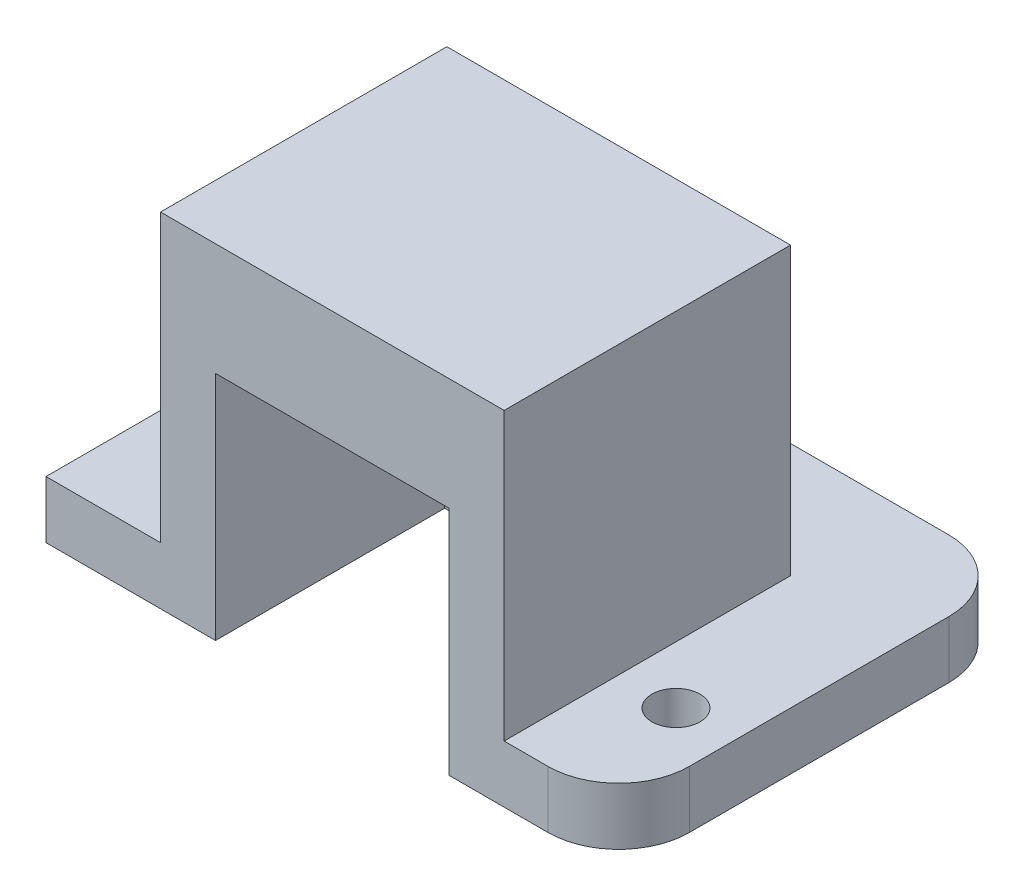
ISO-10303-21;
HEADER;
FILE_DESCRIPTION(('STEP AP214'),'2;1');
FILE_NAME('part.step','',(''),(''),'','','');
FILE_SCHEMA(('AUTOMOTIVE_DESIGN { 1 0 10303 214 1 1 1 1 }'));
ENDSEC;
DATA;
#1=APPLICATION_CONTEXT('core data for automotive mechanical design processes');
#2=APPLICATION_PROTOCOL_DEFINITION('international standard','automotive_design',2000,#1);
#3=PRODUCT_CONTEXT('',#1,'mechanical');
#4=PRODUCT('Part','Part','',(#3));
#5=PRODUCT_RELATED_PRODUCT_CATEGORY('part','',(#4));
#6=PRODUCT_DEFINITION_FORMATION('','',#4);
#7=PRODUCT_DEFINITION_CONTEXT('part definition',#1,'design');
#8=PRODUCT_DEFINITION('design','',#6,#7);
#9=PRODUCT_DEFINITION_SHAPE('','',#8);
#10=(LENGTH_UNIT() NAMED_UNIT(*) SI_UNIT(.MILLI.,.METRE.));
#11=(NAMED_UNIT(*) PLANE_ANGLE_UNIT() SI_UNIT($,.RADIAN.));
#12=(NAMED_UNIT(*) SI_UNIT($,.STERADIAN.) SOLID_ANGLE_UNIT());
#13=UNCERTAINTY_MEASURE_WITH_UNIT(LENGTH_MEASURE(1.E-05),#10,'distance_accuracy_value','');
#14=(GEOMETRIC_REPRESENTATION_CONTEXT(3) GLOBAL_UNCERTAINTY_ASSIGNED_CONTEXT((#13)) GLOBAL_UNIT_ASSIGNED_CONTEXT((#10,
#11,#12)) REPRESENTATION_CONTEXT('',''));
#15=CARTESIAN_POINT('',(0.,0.,0.));
#16=DIRECTION('',(0.,0.,1.));
#17=DIRECTION('',(1.,0.,0.));
#18=AXIS2_PLACEMENT_3D('',#15,#16,#17);
#19=CARTESIAN_POINT('',(18.83,0.,-3.83));
#20=DIRECTION('',(0.,1.,0.));
#21=DIRECTION('',(0.,0.,1.));
#22=AXIS2_PLACEMENT_3D('',#19,#20,#21);
#23=CYLINDRICAL_SURFACE('',#22,6.17);
#24=DIRECTION('',(0.,1.,0.));
#25=VECTOR('',#24,1.);
#26=CARTESIAN_POINT('',(25.,0.,-3.83));
#27=LINE('',#26,#25);
#28=CARTESIAN_POINT('',(25.,-15.,-3.83));
#29=VERTEX_POINT('',#28);
#30=CARTESIAN_POINT('',(25.,-9.99999999999999,-3.83));
#31=VERTEX_POINT('',#30);
#32=EDGE_CURVE('E247',#29,#31,#27,.T.);
#33=ORIENTED_EDGE('',*,*,#32,.F.);
#34=CARTESIAN_POINT('',(18.83,-15.,-3.83));
#35=DIRECTION('',(0.,1.,0.));
#36=DIRECTION('',(0.,0.,1.));
#37=AXIS2_PLACEMENT_3D('',#34,#35,#36);
#38=CIRCLE('',#37,6.17);
#39=CARTESIAN_POINT('',(18.83,-15.,-10.));
#40=VERTEX_POINT('',#39);
#41=EDGE_CURVE('E44',#40,#29,#38,.F.);
#42=ORIENTED_EDGE('',*,*,#41,.F.);
#43=DIRECTION('',(0.,1.,0.));
#44=VECTOR('',#43,1.);
#45=CARTESIAN_POINT('',(18.83,0.,-10.));
#46=LINE('',#45,#44);
#47=CARTESIAN_POINT('',(18.83,-9.99999999999999,-10.));
#48=VERTEX_POINT('',#47);
#49=EDGE_CURVE('E250',#48,#40,#46,.F.);
#50=ORIENTED_EDGE('',*,*,#49,.F.);
#51=CARTESIAN_POINT('',(18.83,-9.99999999999999,-3.83));
#52=DIRECTION('',(0.,-1.,0.));
#53=DIRECTION('',(0.,0.,-1.));
#54=AXIS2_PLACEMENT_3D('',#51,#52,#53);
#55=CIRCLE('',#54,6.17);
#56=EDGE_CURVE('E11',#31,#48,#55,.F.);
#57=ORIENTED_EDGE('',*,*,#56,.F.);
#58=EDGE_LOOP('',(#33,#42,#50,#57));
#59=FACE_BOUND('',#58,.T.);
#60=ADVANCED_FACE('F37',(#59),#23,.T.);
#61=CARTESIAN_POINT('',(18.83,0.,18.83));
#62=DIRECTION('',(0.,-1.,0.));
#63=DIRECTION('',(0.,0.,-1.));
#64=AXIS2_PLACEMENT_3D('',#61,#62,#63);
#65=CYLINDRICAL_SURFACE('',#64,6.17);
#66=DIRECTION('',(0.,-1.,0.));
#67=VECTOR('',#66,1.);
#68=CARTESIAN_POINT('',(25.,0.,18.83));
#69=LINE('',#68,#67);
#70=CARTESIAN_POINT('',(25.,-9.99999999999999,18.83));
#71=VERTEX_POINT('',#70);
#72=CARTESIAN_POINT('',(25.,-15.,18.83));
#73=VERTEX_POINT('',#72);
#74=EDGE_CURVE('E162',#71,#73,#69,.T.);
#75=ORIENTED_EDGE('',*,*,#74,.F.);
#76=CARTESIAN_POINT('',(18.83,-9.99999999999999,18.83));
#77=DIRECTION('',(0.,-1.,0.));
#78=DIRECTION('',(0.,0.,-1.));
#79=AXIS2_PLACEMENT_3D('',#76,#77,#78);
#80=CIRCLE('',#79,6.17);
#81=CARTESIAN_POINT('',(18.83,-9.99999999999999,25.));
#82=VERTEX_POINT('',#81);
#83=EDGE_CURVE('E243',#82,#71,#80,.F.);
#84=ORIENTED_EDGE('',*,*,#83,.F.);
#85=DIRECTION('',(0.,-1.,0.));
#86=VECTOR('',#85,1.);
#87=CARTESIAN_POINT('',(18.83,0.,25.));
#88=LINE('',#87,#86);
#89=CARTESIAN_POINT('',(18.83,-15.,25.));
#90=VERTEX_POINT('',#89);
#91=EDGE_CURVE('E142',#90,#82,#88,.F.);
#92=ORIENTED_EDGE('',*,*,#91,.F.);
#93=CARTESIAN_POINT('',(18.83,-15.,18.83));
#94=DIRECTION('',(0.,1.,0.));
#95=DIRECTION('',(0.,0.,1.));
#96=AXIS2_PLACEMENT_3D('',#93,#94,#95);
#97=CIRCLE('',#96,6.17);
#98=EDGE_CURVE('E245',#73,#90,#97,.F.);
#99=ORIENTED_EDGE('',*,*,#98,.F.);
#100=EDGE_LOOP('',(#75,#84,#92,#99));
#101=FACE_BOUND('',#100,.T.);
#102=ADVANCED_FACE('F304',(#101),#65,.T.);
#103=CARTESIAN_POINT('',(-15.,15.,5.));
#104=DIRECTION('',(1.,0.,0.));
#105=DIRECTION('',(0.,1.,0.));
#106=AXIS2_PLACEMENT_3D('',#103,#104,#105);
#107=PLANE('',#106);
#108=DIRECTION('',(0.,0.,-1.));
#109=VECTOR('',#108,1.);
#110=CARTESIAN_POINT('',(-15.,-9.99999999999999,-10.));
#111=LINE('',#110,#109);
#112=CARTESIAN_POINT('',(-15.,-9.99999999999999,25.));
#113=VERTEX_POINT('',#112);
#114=CARTESIAN_POINT('',(-15.,-9.99999999999999,0.));
#115=VERTEX_POINT('',#114);
#116=EDGE_CURVE('E145',#113,#115,#111,.T.);
#117=ORIENTED_EDGE('',*,*,#116,.F.);
#118=DIRECTION('',(0.,-1.,0.));
#119=VECTOR('',#118,1.);
#120=CARTESIAN_POINT('',(-15.,-15.,25.));
#121=LINE('',#120,#119);
#122=CARTESIAN_POINT('',(-15.,15.,25.));
#123=VERTEX_POINT('',#122);
#124=EDGE_CURVE('E186',#123,#113,#121,.T.);
#125=ORIENTED_EDGE('',*,*,#124,.F.);
#126=DIRECTION('',(0.,0.,-1.));
#127=VECTOR('',#126,1.);
#128=CARTESIAN_POINT('',(-15.,15.,5.));
#129=LINE('',#128,#127);
#130=CARTESIAN_POINT('',(-15.,15.,0.));
#131=VERTEX_POINT('',#130);
#132=EDGE_CURVE('E166',#123,#131,#129,.T.);
#133=ORIENTED_EDGE('',*,*,#132,.T.);
#134=DIRECTION('',(0.,-1.,0.));
#135=VECTOR('',#134,1.);
#136=CARTESIAN_POINT('',(-15.,15.,0.));
#137=LINE('',#136,#135);
#138=EDGE_CURVE('E230',#131,#115,#137,.T.);
#139=ORIENTED_EDGE('',*,*,#138,.T.);
#140=EDGE_LOOP('',(#117,#125,#133,#139));
#141=FACE_BOUND('',#140,.T.);
#142=ADVANCED_FACE('F309',(#141),#107,.F.);
#143=CARTESIAN_POINT('',(0.,0.,0.));
#144=DIRECTION('',(0.,0.,1.));
#145=DIRECTION('',(1.,0.,0.));
#146=AXIS2_PLACEMENT_3D('',#143,#144,#145);
#147=PLANE('',#146);
#148=DIRECTION('',(1.,0.,0.));
#149=VECTOR('',#148,1.);
#150=CARTESIAN_POINT('',(15.,-9.99999999999999,0.));
#151=LINE('',#150,#149);
#152=CARTESIAN_POINT('',(15.,-9.99999999999999,0.));
#153=VERTEX_POINT('',#152);
#154=EDGE_CURVE('E161',#115,#153,#151,.T.);
#155=ORIENTED_EDGE('',*,*,#154,.F.);
#156=ORIENTED_EDGE('',*,*,#138,.F.);
#157=DIRECTION('',(1.,0.,0.));
#158=VECTOR('',#157,1.);
#159=CARTESIAN_POINT('',(-15.,15.,0.));
#160=LINE('',#159,#158);
#161=CARTESIAN_POINT('',(15.,15.,0.));
#162=VERTEX_POINT('',#161);
#163=EDGE_CURVE('E234',#131,#162,#160,.T.);
#164=ORIENTED_EDGE('',*,*,#163,.T.);
#165=DIRECTION('',(0.,-1.,0.));
#166=VECTOR('',#165,1.);
#167=CARTESIAN_POINT('',(15.,15.,0.));
#168=LINE('',#167,#166);
#169=EDGE_CURVE('E237',#162,#153,#168,.T.);
#170=ORIENTED_EDGE('',*,*,#169,.T.);
#171=EDGE_LOOP('',(#155,#156,#164,#170));
#172=FACE_BOUND('',#171,.T.);
#173=ADVANCED_FACE('F314',(#172),#147,.F.);
#174=CARTESIAN_POINT('',(-15.,-15.,5.));
#175=DIRECTION('',(0.,1.,0.));
#176=DIRECTION('',(0.,0.,1.));
#177=AXIS2_PLACEMENT_3D('',#174,#175,#176);
#178=PLANE('',#177);
#179=CARTESIAN_POINT('',(-20.,-15.,15.));
#180=DIRECTION('',(0.,1.,0.));
#181=DIRECTION('',(0.,0.,1.));
#182=AXIS2_PLACEMENT_3D('',#179,#180,#181);
#183=CIRCLE('',#182,2.1);
#184=CARTESIAN_POINT('',(-20.,-15.,17.1));
#185=VERTEX_POINT('',#184);
#186=EDGE_CURVE('E261',#185,#185,#183,.T.);
#187=ORIENTED_EDGE('',*,*,#186,.T.);
#188=EDGE_LOOP('',(#187));
#189=FACE_BOUND('',#188,.T.);
#190=CARTESIAN_POINT('',(20.,-15.,15.));
#191=DIRECTION('',(0.,1.,0.));
#192=DIRECTION('',(0.,0.,1.));
#193=AXIS2_PLACEMENT_3D('',#190,#191,#192);
#194=CIRCLE('',#193,2.1);
#195=CARTESIAN_POINT('',(20.,-15.,17.1));
#196=VERTEX_POINT('',#195);
#197=EDGE_CURVE('E263',#196,#196,#194,.T.);
#198=ORIENTED_EDGE('',*,*,#197,.T.);
#199=EDGE_LOOP('',(#198));
#200=FACE_BOUND('',#199,.T.);
#201=CARTESIAN_POINT('',(0.,-15.,-5.));
#202=DIRECTION('',(0.,1.,0.));
#203=DIRECTION('',(0.,0.,1.));
#204=AXIS2_PLACEMENT_3D('',#201,#202,#203);
#205=CIRCLE('',#204,2.1);
#206=CARTESIAN_POINT('',(0.,-15.,-2.9));
#207=VERTEX_POINT('',#206);
#208=EDGE_CURVE('E220',#207,#207,#205,.T.);
#209=ORIENTED_EDGE('',*,*,#208,.T.);
#210=EDGE_LOOP('',(#209));
#211=FACE_BOUND('',#210,.T.);
#212=DIRECTION('',(-1.,0.,0.));
#213=VECTOR('',#212,1.);
#214=CARTESIAN_POINT('',(15.,-15.,-10.));
#215=LINE('',#214,#213);
#216=CARTESIAN_POINT('',(-25.,-15.,-10.));
#217=VERTEX_POINT('',#216);
#218=EDGE_CURVE('E225',#40,#217,#215,.T.);
#219=ORIENTED_EDGE('',*,*,#218,.F.);
#220=ORIENTED_EDGE('',*,*,#41,.T.);
#221=DIRECTION('',(0.,0.,-1.));
#222=VECTOR('',#221,1.);
#223=CARTESIAN_POINT('',(25.,-15.,25.));
#224=LINE('',#223,#222);
#225=EDGE_CURVE('E256',#73,#29,#224,.T.);
#226=ORIENTED_EDGE('',*,*,#225,.F.);
#227=ORIENTED_EDGE('',*,*,#98,.T.);
#228=DIRECTION('',(1.,0.,0.));
#229=VECTOR('',#228,1.);
#230=CARTESIAN_POINT('',(10.2,-15.,25.));
#231=LINE('',#230,#229);
#232=CARTESIAN_POINT('',(10.2,-15.,25.));
#233=VERTEX_POINT('',#232);
#234=EDGE_CURVE('E156',#233,#90,#231,.T.);
#235=ORIENTED_EDGE('',*,*,#234,.F.);
#236=DIRECTION('',(0.,0.,-1.));
#237=VECTOR('',#236,1.);
#238=CARTESIAN_POINT('',(10.2,-15.,25.));
#239=LINE('',#238,#237);
#240=CARTESIAN_POINT('',(10.2,-15.,5.));
#241=VERTEX_POINT('',#240);
#242=EDGE_CURVE('E200',#233,#241,#239,.T.);
#243=ORIENTED_EDGE('',*,*,#242,.T.);
#244=DIRECTION('',(1.,0.,0.));
#245=VECTOR('',#244,1.);
#246=CARTESIAN_POINT('',(-15.,-15.,5.));
#247=LINE('',#246,#245);
#248=CARTESIAN_POINT('',(-10.2,-15.,5.));
#249=VERTEX_POINT('',#248);
#250=EDGE_CURVE('E232',#249,#241,#247,.T.);
#251=ORIENTED_EDGE('',*,*,#250,.F.);
#252=DIRECTION('',(0.,0.,-1.));
#253=VECTOR('',#252,1.);
#254=CARTESIAN_POINT('',(-10.2,-15.,25.));
#255=LINE('',#254,#253);
#256=CARTESIAN_POINT('',(-10.2,-15.,25.));
#257=VERTEX_POINT('',#256);
#258=EDGE_CURVE('E216',#257,#249,#255,.T.);
#259=ORIENTED_EDGE('',*,*,#258,.F.);
#260=DIRECTION('',(1.,0.,0.));
#261=VECTOR('',#260,1.);
#262=CARTESIAN_POINT('',(-15.,-15.,25.));
#263=LINE('',#262,#261);
#264=CARTESIAN_POINT('',(-25.,-15.,25.));
#265=VERTEX_POINT('',#264);
#266=EDGE_CURVE('E189',#265,#257,#263,.T.);
#267=ORIENTED_EDGE('',*,*,#266,.F.);
#268=DIRECTION('',(0.,0.,1.));
#269=VECTOR('',#268,1.);
#270=CARTESIAN_POINT('',(-25.,-15.,-10.));
#271=LINE('',#270,#269);
#272=EDGE_CURVE('E174',#217,#265,#271,.T.);
#273=ORIENTED_EDGE('',*,*,#272,.F.);
#274=EDGE_LOOP('',(#219,#220,#226,#227,#235,#243,#251,#259,#267,#273));
#275=FACE_BOUND('',#274,.T.);
#276=ADVANCED_FACE('F254',(#189,#200,#211,#275),#178,.F.);
#277=CARTESIAN_POINT('',(15.,15.,5.));
#278=DIRECTION('',(1.,0.,0.));
#279=DIRECTION('',(0.,1.,0.));
#280=AXIS2_PLACEMENT_3D('',#277,#278,#279);
#281=PLANE('',#280);
#282=DIRECTION('',(0.,0.,1.));
#283=VECTOR('',#282,1.);
#284=CARTESIAN_POINT('',(15.,-9.99999999999999,25.));
#285=LINE('',#284,#283);
#286=CARTESIAN_POINT('',(15.,-9.99999999999999,25.));
#287=VERTEX_POINT('',#286);
#288=EDGE_CURVE('E151',#153,#287,#285,.T.);
#289=ORIENTED_EDGE('',*,*,#288,.F.);
#290=ORIENTED_EDGE('',*,*,#169,.F.);
#291=DIRECTION('',(0.,0.,-1.));
#292=VECTOR('',#291,1.);
#293=CARTESIAN_POINT('',(15.,15.,5.));
#294=LINE('',#293,#292);
#295=CARTESIAN_POINT('',(15.,15.,25.));
#296=VERTEX_POINT('',#295);
#297=EDGE_CURVE('E153',#296,#162,#294,.T.);
#298=ORIENTED_EDGE('',*,*,#297,.F.);
#299=DIRECTION('',(0.,1.,0.));
#300=VECTOR('',#299,1.);
#301=CARTESIAN_POINT('',(15.,-15.,25.));
#302=LINE('',#301,#300);
#303=EDGE_CURVE('E139',#287,#296,#302,.T.);
#304=ORIENTED_EDGE('',*,*,#303,.F.);
#305=EDGE_LOOP('',(#289,#290,#298,#304));
#306=FACE_BOUND('',#305,.T.);
#307=ADVANCED_FACE('F149',(#306),#281,.T.);
#308=CARTESIAN_POINT('',(-15.,15.,5.));
#309=DIRECTION('',(0.,1.,0.));
#310=DIRECTION('',(0.,0.,1.));
#311=AXIS2_PLACEMENT_3D('',#308,#309,#310);
#312=PLANE('',#311);
#313=ORIENTED_EDGE('',*,*,#163,.F.);
#314=ORIENTED_EDGE('',*,*,#132,.F.);
#315=DIRECTION('',(-1.,0.,0.));
#316=VECTOR('',#315,1.);
#317=CARTESIAN_POINT('',(-15.,15.,25.));
#318=LINE('',#317,#316);
#319=EDGE_CURVE('E155',#296,#123,#318,.T.);
#320=ORIENTED_EDGE('',*,*,#319,.F.);
#321=ORIENTED_EDGE('',*,*,#297,.T.);
#322=EDGE_LOOP('',(#313,#314,#320,#321));
#323=FACE_BOUND('',#322,.T.);
#324=ADVANCED_FACE('F323',(#323),#312,.T.);
#325=CARTESIAN_POINT('',(0.,0.,5.));
#326=DIRECTION('',(0.,0.,1.));
#327=DIRECTION('',(1.,0.,0.));
#328=AXIS2_PLACEMENT_3D('',#325,#326,#327);
#329=PLANE('',#328);
#330=DIRECTION('',(0.,-1.,0.));
#331=VECTOR('',#330,1.);
#332=CARTESIAN_POINT('',(10.2,-15.,5.));
#333=LINE('',#332,#331);
#334=CARTESIAN_POINT('',(10.2,5.2,5.));
#335=VERTEX_POINT('',#334);
#336=EDGE_CURVE('E190',#335,#241,#333,.T.);
#337=ORIENTED_EDGE('',*,*,#336,.F.);
#338=DIRECTION('',(1.,0.,0.));
#339=VECTOR('',#338,1.);
#340=CARTESIAN_POINT('',(-10.2,5.2,5.));
#341=LINE('',#340,#339);
#342=CARTESIAN_POINT('',(-10.2,5.2,5.));
#343=VERTEX_POINT('',#342);
#344=EDGE_CURVE('E203',#343,#335,#341,.T.);
#345=ORIENTED_EDGE('',*,*,#344,.F.);
#346=DIRECTION('',(0.,1.,0.));
#347=VECTOR('',#346,1.);
#348=CARTESIAN_POINT('',(-10.2,-15.,5.));
#349=LINE('',#348,#347);
#350=EDGE_CURVE('E185',#249,#343,#349,.T.);
#351=ORIENTED_EDGE('',*,*,#350,.F.);
#352=ORIENTED_EDGE('',*,*,#250,.T.);
#353=EDGE_LOOP('',(#337,#345,#351,#352));
#354=FACE_BOUND('',#353,.T.);
#355=ADVANCED_FACE('F281',(#354),#329,.T.);
#356=CARTESIAN_POINT('',(15.,-9.99999999999999,-10.));
#357=DIRECTION('',(0.,-1.,0.));
#358=DIRECTION('',(0.,0.,-1.));
#359=AXIS2_PLACEMENT_3D('',#356,#357,#358);
#360=PLANE('',#359);
#361=CARTESIAN_POINT('',(-20.,-9.99999999999999,15.));
#362=DIRECTION('',(0.,1.,0.));
#363=DIRECTION('',(0.,0.,1.));
#364=AXIS2_PLACEMENT_3D('',#361,#362,#363);
#365=CIRCLE('',#364,2.1);
#366=CARTESIAN_POINT('',(-20.,-9.99999999999999,17.1));
#367=VERTEX_POINT('',#366);
#368=EDGE_CURVE('E268',#367,#367,#365,.T.);
#369=ORIENTED_EDGE('',*,*,#368,.F.);
#370=EDGE_LOOP('',(#369));
#371=FACE_BOUND('',#370,.T.);
#372=CARTESIAN_POINT('',(20.,-9.99999999999999,15.));
#373=DIRECTION('',(0.,1.,0.));
#374=DIRECTION('',(0.,0.,1.));
#375=AXIS2_PLACEMENT_3D('',#372,#373,#374);
#376=CIRCLE('',#375,2.1);
#377=CARTESIAN_POINT('',(20.,-9.99999999999999,17.1));
#378=VERTEX_POINT('',#377);
#379=EDGE_CURVE('E269',#378,#378,#376,.T.);
#380=ORIENTED_EDGE('',*,*,#379,.F.);
#381=EDGE_LOOP('',(#380));
#382=FACE_BOUND('',#381,.T.);
#383=CARTESIAN_POINT('',(0.,-9.99999999999999,-5.));
#384=DIRECTION('',(0.,1.,0.));
#385=DIRECTION('',(0.,0.,1.));
#386=AXIS2_PLACEMENT_3D('',#383,#384,#385);
#387=CIRCLE('',#386,2.1);
#388=CARTESIAN_POINT('',(0.,-9.99999999999999,-2.9));
#389=VERTEX_POINT('',#388);
#390=EDGE_CURVE('E219',#389,#389,#387,.T.);
#391=ORIENTED_EDGE('',*,*,#390,.F.);
#392=EDGE_LOOP('',(#391));
#393=FACE_BOUND('',#392,.T.);
#394=DIRECTION('',(0.,0.,1.));
#395=VECTOR('',#394,1.);
#396=CARTESIAN_POINT('',(25.,-9.99999999999999,25.));
#397=LINE('',#396,#395);
#398=EDGE_CURVE('E146',#31,#71,#397,.T.);
#399=ORIENTED_EDGE('',*,*,#398,.F.);
#400=ORIENTED_EDGE('',*,*,#56,.T.);
#401=DIRECTION('',(1.,0.,0.));
#402=VECTOR('',#401,1.);
#403=CARTESIAN_POINT('',(15.,-9.99999999999999,-10.));
#404=LINE('',#403,#402);
#405=CARTESIAN_POINT('',(-25.,-9.99999999999999,-10.));
#406=VERTEX_POINT('',#405);
#407=EDGE_CURVE('E227',#406,#48,#404,.T.);
#408=ORIENTED_EDGE('',*,*,#407,.F.);
#409=DIRECTION('',(0.,0.,-1.));
#410=VECTOR('',#409,1.);
#411=CARTESIAN_POINT('',(-25.,-9.99999999999999,-10.));
#412=LINE('',#411,#410);
#413=CARTESIAN_POINT('',(-25.,-9.99999999999999,25.));
#414=VERTEX_POINT('',#413);
#415=EDGE_CURVE('E179',#414,#406,#412,.T.);
#416=ORIENTED_EDGE('',*,*,#415,.F.);
#417=DIRECTION('',(1.,0.,0.));
#418=VECTOR('',#417,1.);
#419=CARTESIAN_POINT('',(-25.,-9.99999999999999,25.));
#420=LINE('',#419,#418);
#421=EDGE_CURVE('E182',#414,#113,#420,.T.);
#422=ORIENTED_EDGE('',*,*,#421,.T.);
#423=ORIENTED_EDGE('',*,*,#116,.T.);
#424=ORIENTED_EDGE('',*,*,#154,.T.);
#425=ORIENTED_EDGE('',*,*,#288,.T.);
#426=DIRECTION('',(-1.,0.,0.));
#427=VECTOR('',#426,1.);
#428=CARTESIAN_POINT('',(25.,-9.99999999999999,25.));
#429=LINE('',#428,#427);
#430=EDGE_CURVE('E134',#82,#287,#429,.T.);
#431=ORIENTED_EDGE('',*,*,#430,.F.);
#432=ORIENTED_EDGE('',*,*,#83,.T.);
#433=EDGE_LOOP('',(#399,#400,#408,#416,#422,#423,#424,#425,#431,#432));
#434=FACE_BOUND('',#433,.T.);
#435=ADVANCED_FACE('F159',(#371,#382,#393,#434),#360,.F.);
#436=CARTESIAN_POINT('',(0.,0.,-10.));
#437=DIRECTION('',(0.,0.,1.));
#438=DIRECTION('',(1.,0.,0.));
#439=AXIS2_PLACEMENT_3D('',#436,#437,#438);
#440=PLANE('',#439);
#441=ORIENTED_EDGE('',*,*,#407,.T.);
#442=ORIENTED_EDGE('',*,*,#49,.T.);
#443=ORIENTED_EDGE('',*,*,#218,.T.);
#444=DIRECTION('',(0.,-1.,0.));
#445=VECTOR('',#444,1.);
#446=CARTESIAN_POINT('',(-25.,-15.,-10.));
#447=LINE('',#446,#445);
#448=EDGE_CURVE('E171',#406,#217,#447,.T.);
#449=ORIENTED_EDGE('',*,*,#448,.F.);
#450=EDGE_LOOP('',(#441,#442,#443,#449));
#451=FACE_BOUND('',#450,.T.);
#452=ADVANCED_FACE('F280',(#451),#440,.F.);
#453=CARTESIAN_POINT('',(0.,-15.,-5.));
#454=DIRECTION('',(0.,1.,0.));
#455=DIRECTION('',(0.,0.,1.));
#456=AXIS2_PLACEMENT_3D('',#453,#454,#455);
#457=CYLINDRICAL_SURFACE('',#456,2.1);
#458=ORIENTED_EDGE('',*,*,#208,.F.);
#459=EDGE_LOOP('',(#458));
#460=FACE_BOUND('',#459,.T.);
#461=ORIENTED_EDGE('',*,*,#390,.T.);
#462=EDGE_LOOP('',(#461));
#463=FACE_BOUND('',#462,.T.);
#464=ADVANCED_FACE('F287',(#460,#463),#457,.F.);
#465=CARTESIAN_POINT('',(-10.2,-15.,25.));
#466=DIRECTION('',(-1.,0.,0.));
#467=DIRECTION('',(0.,0.,1.));
#468=AXIS2_PLACEMENT_3D('',#465,#466,#467);
#469=PLANE('',#468);
#470=ORIENTED_EDGE('',*,*,#350,.T.);
#471=DIRECTION('',(0.,0.,-1.));
#472=VECTOR('',#471,1.);
#473=CARTESIAN_POINT('',(-10.2,5.2,25.));
#474=LINE('',#473,#472);
#475=CARTESIAN_POINT('',(-10.2,5.2,25.));
#476=VERTEX_POINT('',#475);
#477=EDGE_CURVE('E213',#476,#343,#474,.T.);
#478=ORIENTED_EDGE('',*,*,#477,.F.);
#479=DIRECTION('',(0.,1.,0.));
#480=VECTOR('',#479,1.);
#481=CARTESIAN_POINT('',(-10.2,-15.,25.));
#482=LINE('',#481,#480);
#483=EDGE_CURVE('E192',#257,#476,#482,.T.);
#484=ORIENTED_EDGE('',*,*,#483,.F.);
#485=ORIENTED_EDGE('',*,*,#258,.T.);
#486=EDGE_LOOP('',(#470,#478,#484,#485));
#487=FACE_BOUND('',#486,.T.);
#488=ADVANCED_FACE('F289',(#487),#469,.F.);
#489=CARTESIAN_POINT('',(-10.2,5.2,25.));
#490=DIRECTION('',(0.,1.,0.));
#491=DIRECTION('',(0.,0.,1.));
#492=AXIS2_PLACEMENT_3D('',#489,#490,#491);
#493=PLANE('',#492);
#494=ORIENTED_EDGE('',*,*,#344,.T.);
#495=DIRECTION('',(0.,0.,-1.));
#496=VECTOR('',#495,1.);
#497=CARTESIAN_POINT('',(10.2,5.2,25.));
#498=LINE('',#497,#496);
#499=CARTESIAN_POINT('',(10.2,5.2,25.));
#500=VERTEX_POINT('',#499);
#501=EDGE_CURVE('E210',#500,#335,#498,.T.);
#502=ORIENTED_EDGE('',*,*,#501,.F.);
#503=DIRECTION('',(1.,0.,0.));
#504=VECTOR('',#503,1.);
#505=CARTESIAN_POINT('',(-10.2,5.2,25.));
#506=LINE('',#505,#504);
#507=EDGE_CURVE('E194',#476,#500,#506,.T.);
#508=ORIENTED_EDGE('',*,*,#507,.F.);
#509=ORIENTED_EDGE('',*,*,#477,.T.);
#510=EDGE_LOOP('',(#494,#502,#508,#509));
#511=FACE_BOUND('',#510,.T.);
#512=ADVANCED_FACE('F296',(#511),#493,.F.);
#513=CARTESIAN_POINT('',(10.2,-15.,25.));
#514=DIRECTION('',(1.,0.,0.));
#515=DIRECTION('',(0.,0.,-1.));
#516=AXIS2_PLACEMENT_3D('',#513,#514,#515);
#517=PLANE('',#516);
#518=ORIENTED_EDGE('',*,*,#336,.T.);
#519=ORIENTED_EDGE('',*,*,#242,.F.);
#520=DIRECTION('',(0.,-1.,0.));
#521=VECTOR('',#520,1.);
#522=CARTESIAN_POINT('',(10.2,-15.,25.));
#523=LINE('',#522,#521);
#524=EDGE_CURVE('E196',#500,#233,#523,.T.);
#525=ORIENTED_EDGE('',*,*,#524,.F.);
#526=ORIENTED_EDGE('',*,*,#501,.T.);
#527=EDGE_LOOP('',(#518,#519,#525,#526));
#528=FACE_BOUND('',#527,.T.);
#529=ADVANCED_FACE('F343',(#528),#517,.F.);
#530=CARTESIAN_POINT('',(0.,0.,25.));
#531=DIRECTION('',(0.,0.,-1.));
#532=DIRECTION('',(-1.,0.,0.));
#533=AXIS2_PLACEMENT_3D('',#530,#531,#532);
#534=PLANE('',#533);
#535=ORIENTED_EDGE('',*,*,#234,.T.);
#536=ORIENTED_EDGE('',*,*,#91,.T.);
#537=ORIENTED_EDGE('',*,*,#430,.T.);
#538=ORIENTED_EDGE('',*,*,#303,.T.);
#539=ORIENTED_EDGE('',*,*,#319,.T.);
#540=ORIENTED_EDGE('',*,*,#124,.T.);
#541=ORIENTED_EDGE('',*,*,#421,.F.);
#542=DIRECTION('',(0.,1.,0.));
#543=VECTOR('',#542,1.);
#544=CARTESIAN_POINT('',(-25.,-15.,25.));
#545=LINE('',#544,#543);
#546=EDGE_CURVE('E177',#265,#414,#545,.T.);
#547=ORIENTED_EDGE('',*,*,#546,.F.);
#548=ORIENTED_EDGE('',*,*,#266,.T.);
#549=ORIENTED_EDGE('',*,*,#483,.T.);
#550=ORIENTED_EDGE('',*,*,#507,.T.);
#551=ORIENTED_EDGE('',*,*,#524,.T.);
#552=EDGE_LOOP('',(#535,#536,#537,#538,#539,#540,#541,#547,#548,#549,#550,#551));
#553=FACE_BOUND('',#552,.T.);
#554=ADVANCED_FACE('F137',(#553),#534,.F.);
#555=CARTESIAN_POINT('',(-25.,0.,0.));
#556=DIRECTION('',(1.,0.,0.));
#557=DIRECTION('',(0.,0.,-1.));
#558=AXIS2_PLACEMENT_3D('',#555,#556,#557);
#559=PLANE('',#558);
#560=ORIENTED_EDGE('',*,*,#448,.T.);
#561=ORIENTED_EDGE('',*,*,#272,.T.);
#562=ORIENTED_EDGE('',*,*,#546,.T.);
#563=ORIENTED_EDGE('',*,*,#415,.T.);
#564=EDGE_LOOP('',(#560,#561,#562,#563));
#565=FACE_BOUND('',#564,.T.);
#566=ADVANCED_FACE('F349',(#565),#559,.F.);
#567=CARTESIAN_POINT('',(25.,0.,0.));
#568=DIRECTION('',(-1.,0.,0.));
#569=DIRECTION('',(0.,0.,1.));
#570=AXIS2_PLACEMENT_3D('',#567,#568,#569);
#571=PLANE('',#570);
#572=ORIENTED_EDGE('',*,*,#225,.T.);
#573=ORIENTED_EDGE('',*,*,#32,.T.);
#574=ORIENTED_EDGE('',*,*,#398,.T.);
#575=ORIENTED_EDGE('',*,*,#74,.T.);
#576=EDGE_LOOP('',(#572,#573,#574,#575));
#577=FACE_BOUND('',#576,.T.);
#578=ADVANCED_FACE('F259',(#577),#571,.F.);
#579=CARTESIAN_POINT('',(20.,-20.,15.));
#580=DIRECTION('',(0.,1.,0.));
#581=DIRECTION('',(0.,0.,1.));
#582=AXIS2_PLACEMENT_3D('',#579,#580,#581);
#583=CYLINDRICAL_SURFACE('',#582,2.1);
#584=ORIENTED_EDGE('',*,*,#379,.T.);
#585=EDGE_LOOP('',(#584));
#586=FACE_BOUND('',#585,.T.);
#587=ORIENTED_EDGE('',*,*,#197,.F.);
#588=EDGE_LOOP('',(#587));
#589=FACE_BOUND('',#588,.T.);
#590=ADVANCED_FACE('F364',(#586,#589),#583,.F.);
#591=CARTESIAN_POINT('',(-20.,-20.,15.));
#592=DIRECTION('',(0.,1.,0.));
#593=DIRECTION('',(0.,0.,1.));
#594=AXIS2_PLACEMENT_3D('',#591,#592,#593);
#595=CYLINDRICAL_SURFACE('',#594,2.1);
#596=ORIENTED_EDGE('',*,*,#368,.T.);
#597=EDGE_LOOP('',(#596));
#598=FACE_BOUND('',#597,.T.);
#599=ORIENTED_EDGE('',*,*,#186,.F.);
#600=EDGE_LOOP('',(#599));
#601=FACE_BOUND('',#600,.T.);
#602=ADVANCED_FACE('F275',(#598,#601),#595,.F.);
#603=CLOSED_SHELL('',(#60,#102,#142,#173,#276,#307,#324,#355,#435,#452,#464,#488,#512,#529,#554,
#566,#578,#590,#602));
#604=MANIFOLD_SOLID_BREP('B2',#603);
#605=ADVANCED_BREP_SHAPE_REPRESENTATION('',(#18,#604),#14);
#606=SHAPE_DEFINITION_REPRESENTATION(#9,#605);
ENDSEC;
END-ISO-10303-21;
